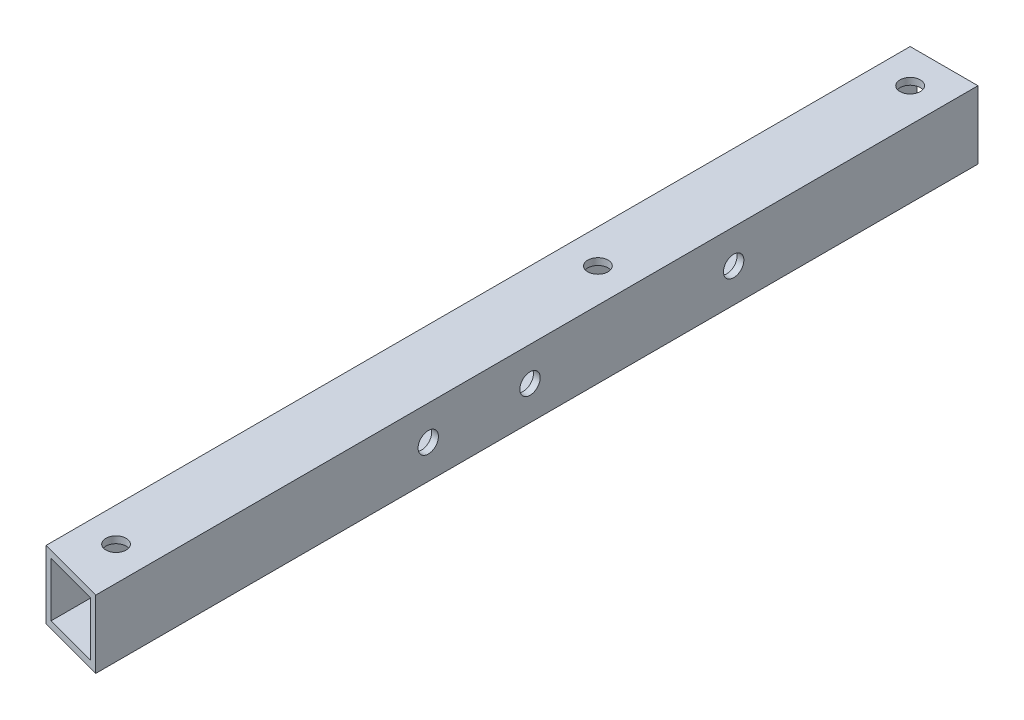
ISO-10303-21;
HEADER;
FILE_DESCRIPTION(('STEP AP214'),'2;1');
FILE_NAME('part.step','',(''),(''),'','','');
FILE_SCHEMA(('AUTOMOTIVE_DESIGN { 1 0 10303 214 1 1 1 1 }'));
ENDSEC;
DATA;
#1=APPLICATION_CONTEXT('core data for automotive mechanical design processes');
#2=APPLICATION_PROTOCOL_DEFINITION('international standard','automotive_design',2000,#1);
#3=PRODUCT_CONTEXT('',#1,'mechanical');
#4=PRODUCT('Part','Part','',(#3));
#5=PRODUCT_RELATED_PRODUCT_CATEGORY('part','',(#4));
#6=PRODUCT_DEFINITION_FORMATION('','',#4);
#7=PRODUCT_DEFINITION_CONTEXT('part definition',#1,'design');
#8=PRODUCT_DEFINITION('design','',#6,#7);
#9=PRODUCT_DEFINITION_SHAPE('','',#8);
#10=(LENGTH_UNIT() NAMED_UNIT(*) SI_UNIT(.MILLI.,.METRE.));
#11=(NAMED_UNIT(*) PLANE_ANGLE_UNIT() SI_UNIT($,.RADIAN.));
#12=(NAMED_UNIT(*) SI_UNIT($,.STERADIAN.) SOLID_ANGLE_UNIT());
#13=UNCERTAINTY_MEASURE_WITH_UNIT(LENGTH_MEASURE(1.E-05),#10,'distance_accuracy_value','');
#14=(GEOMETRIC_REPRESENTATION_CONTEXT(3) GLOBAL_UNCERTAINTY_ASSIGNED_CONTEXT((#13)) GLOBAL_UNIT_ASSIGNED_CONTEXT((#10,
#11,#12)) REPRESENTATION_CONTEXT('',''));
#15=CARTESIAN_POINT('',(0.,0.,0.));
#16=DIRECTION('',(0.,0.,1.));
#17=DIRECTION('',(1.,0.,0.));
#18=AXIS2_PLACEMENT_3D('',#15,#16,#17);
#19=CARTESIAN_POINT('',(0.,0.,0.));
#20=DIRECTION('',(0.,0.,1.));
#21=DIRECTION('',(1.,0.,0.));
#22=AXIS2_PLACEMENT_3D('',#19,#20,#21);
#23=PLANE('',#22);
#24=DIRECTION('',(0.,1.,0.));
#25=VECTOR('',#24,1.);
#26=CARTESIAN_POINT('',(4.99999999999999,5.,0.));
#27=LINE('',#26,#25);
#28=CARTESIAN_POINT('',(5.,-5.,0.));
#29=VERTEX_POINT('',#28);
#30=CARTESIAN_POINT('',(4.99999999999999,5.,0.));
#31=VERTEX_POINT('',#30);
#32=EDGE_CURVE('E158',#29,#31,#27,.T.);
#33=ORIENTED_EDGE('',*,*,#32,.F.);
#34=DIRECTION('',(1.,0.,0.));
#35=VECTOR('',#34,1.);
#36=CARTESIAN_POINT('',(5.,-5.,0.));
#37=LINE('',#36,#35);
#38=CARTESIAN_POINT('',(-5.,-5.,0.));
#39=VERTEX_POINT('',#38);
#40=EDGE_CURVE('E143',#39,#29,#37,.T.);
#41=ORIENTED_EDGE('',*,*,#40,.F.);
#42=DIRECTION('',(0.,-1.,0.));
#43=VECTOR('',#42,1.);
#44=CARTESIAN_POINT('',(-5.,5.,0.));
#45=LINE('',#44,#43);
#46=CARTESIAN_POINT('',(-5.,5.,0.));
#47=VERTEX_POINT('',#46);
#48=EDGE_CURVE('E152',#47,#39,#45,.T.);
#49=ORIENTED_EDGE('',*,*,#48,.F.);
#50=DIRECTION('',(-1.,0.,0.));
#51=VECTOR('',#50,1.);
#52=CARTESIAN_POINT('',(4.99999999999999,5.,0.));
#53=LINE('',#52,#51);
#54=EDGE_CURVE('E160',#31,#47,#53,.T.);
#55=ORIENTED_EDGE('',*,*,#54,.F.);
#56=EDGE_LOOP('',(#33,#41,#49,#55));
#57=FACE_BOUND('',#56,.T.);
#58=DIRECTION('',(0.,1.,0.));
#59=VECTOR('',#58,1.);
#60=CARTESIAN_POINT('',(4.,0.,0.));
#61=LINE('',#60,#59);
#62=CARTESIAN_POINT('',(4.,-4.,0.));
#63=VERTEX_POINT('',#62);
#64=CARTESIAN_POINT('',(3.99999999999999,4.,0.));
#65=VERTEX_POINT('',#64);
#66=EDGE_CURVE('E233',#63,#65,#61,.T.);
#67=ORIENTED_EDGE('',*,*,#66,.T.);
#68=DIRECTION('',(-1.,0.,0.));
#69=VECTOR('',#68,1.);
#70=CARTESIAN_POINT('',(0.,4.,0.));
#71=LINE('',#70,#69);
#72=CARTESIAN_POINT('',(-4.,4.,0.));
#73=VERTEX_POINT('',#72);
#74=EDGE_CURVE('E236',#65,#73,#71,.T.);
#75=ORIENTED_EDGE('',*,*,#74,.T.);
#76=DIRECTION('',(0.,-1.,0.));
#77=VECTOR('',#76,1.);
#78=CARTESIAN_POINT('',(-4.,0.,0.));
#79=LINE('',#78,#77);
#80=CARTESIAN_POINT('',(-4.,-4.,0.));
#81=VERTEX_POINT('',#80);
#82=EDGE_CURVE('E239',#73,#81,#79,.T.);
#83=ORIENTED_EDGE('',*,*,#82,.T.);
#84=DIRECTION('',(1.,0.,0.));
#85=VECTOR('',#84,1.);
#86=CARTESIAN_POINT('',(0.,-4.,0.));
#87=LINE('',#86,#85);
#88=EDGE_CURVE('E242',#81,#63,#87,.T.);
#89=ORIENTED_EDGE('',*,*,#88,.T.);
#90=EDGE_LOOP('',(#67,#75,#83,#89));
#91=FACE_BOUND('',#90,.T.);
#92=ADVANCED_FACE('F65',(#57,#91),#23,.F.);
#93=CARTESIAN_POINT('',(4.99999999999999,5.,130.));
#94=DIRECTION('',(-1.,0.,0.));
#95=DIRECTION('',(0.,-1.,0.));
#96=AXIS2_PLACEMENT_3D('',#93,#94,#95);
#97=PLANE('',#96);
#98=CARTESIAN_POINT('',(5.,0.,36.));
#99=DIRECTION('',(1.,0.,0.));
#100=DIRECTION('',(0.,1.,0.));
#101=AXIS2_PLACEMENT_3D('',#98,#99,#100);
#102=CIRCLE('',#101,1.5);
#103=CARTESIAN_POINT('',(5.,1.50000000000001,36.));
#104=VERTEX_POINT('',#103);
#105=EDGE_CURVE('E373',#104,#104,#102,.T.);
#106=ORIENTED_EDGE('',*,*,#105,.F.);
#107=EDGE_LOOP('',(#106));
#108=FACE_BOUND('',#107,.T.);
#109=CARTESIAN_POINT('',(5.,0.,66.));
#110=DIRECTION('',(1.,0.,0.));
#111=DIRECTION('',(0.,1.,0.));
#112=AXIS2_PLACEMENT_3D('',#109,#110,#111);
#113=CIRCLE('',#112,1.5);
#114=CARTESIAN_POINT('',(5.,1.5,66.));
#115=VERTEX_POINT('',#114);
#116=EDGE_CURVE('E374',#115,#115,#113,.T.);
#117=ORIENTED_EDGE('',*,*,#116,.F.);
#118=EDGE_LOOP('',(#117));
#119=FACE_BOUND('',#118,.T.);
#120=CARTESIAN_POINT('',(5.,0.,81.));
#121=DIRECTION('',(1.,0.,0.));
#122=DIRECTION('',(0.,1.,0.));
#123=AXIS2_PLACEMENT_3D('',#120,#121,#122);
#124=CIRCLE('',#123,1.5);
#125=CARTESIAN_POINT('',(5.,1.49999999999999,81.));
#126=VERTEX_POINT('',#125);
#127=EDGE_CURVE('E383',#126,#126,#124,.T.);
#128=ORIENTED_EDGE('',*,*,#127,.F.);
#129=EDGE_LOOP('',(#128));
#130=FACE_BOUND('',#129,.T.);
#131=ORIENTED_EDGE('',*,*,#32,.T.);
#132=DIRECTION('',(0.,0.,-1.));
#133=VECTOR('',#132,1.);
#134=CARTESIAN_POINT('',(4.99999999999999,5.,130.));
#135=LINE('',#134,#133);
#136=CARTESIAN_POINT('',(5.,5.,130.));
#137=VERTEX_POINT('',#136);
#138=EDGE_CURVE('E74',#137,#31,#135,.T.);
#139=ORIENTED_EDGE('',*,*,#138,.F.);
#140=DIRECTION('',(0.,1.,0.));
#141=VECTOR('',#140,1.);
#142=CARTESIAN_POINT('',(4.99999999999999,5.,130.));
#143=LINE('',#142,#141);
#144=CARTESIAN_POINT('',(5.,-5.,130.));
#145=VERTEX_POINT('',#144);
#146=EDGE_CURVE('E132',#145,#137,#143,.T.);
#147=ORIENTED_EDGE('',*,*,#146,.F.);
#148=DIRECTION('',(0.,0.,-1.));
#149=VECTOR('',#148,1.);
#150=CARTESIAN_POINT('',(5.,-5.,130.));
#151=LINE('',#150,#149);
#152=EDGE_CURVE('E140',#145,#29,#151,.T.);
#153=ORIENTED_EDGE('',*,*,#152,.T.);
#154=EDGE_LOOP('',(#131,#139,#147,#153));
#155=FACE_BOUND('',#154,.T.);
#156=ADVANCED_FACE('F67',(#108,#119,#130,#155),#97,.F.);
#157=CARTESIAN_POINT('',(4.99999999999999,5.,130.));
#158=DIRECTION('',(0.,-1.,0.));
#159=DIRECTION('',(0.,0.,-1.));
#160=AXIS2_PLACEMENT_3D('',#157,#158,#159);
#161=PLANE('',#160);
#162=CARTESIAN_POINT('',(0.,5.,5.));
#163=DIRECTION('',(0.,-1.,0.));
#164=DIRECTION('',(0.,0.,-1.));
#165=AXIS2_PLACEMENT_3D('',#162,#163,#164);
#166=CIRCLE('',#165,1.5);
#167=CARTESIAN_POINT('',(0.,5.,3.5));
#168=VERTEX_POINT('',#167);
#169=EDGE_CURVE('E204',#168,#168,#166,.T.);
#170=ORIENTED_EDGE('',*,*,#169,.T.);
#171=EDGE_LOOP('',(#170));
#172=FACE_BOUND('',#171,.T.);
#173=CARTESIAN_POINT('',(0.,5.,122.));
#174=DIRECTION('',(0.,-1.,0.));
#175=DIRECTION('',(0.,0.,-1.));
#176=AXIS2_PLACEMENT_3D('',#173,#174,#175);
#177=CIRCLE('',#176,1.5);
#178=CARTESIAN_POINT('',(0.,5.,120.5));
#179=VERTEX_POINT('',#178);
#180=EDGE_CURVE('E210',#179,#179,#177,.T.);
#181=ORIENTED_EDGE('',*,*,#180,.T.);
#182=EDGE_LOOP('',(#181));
#183=FACE_BOUND('',#182,.T.);
#184=CARTESIAN_POINT('',(0.,5.,51.));
#185=DIRECTION('',(0.,-1.,0.));
#186=DIRECTION('',(0.,0.,-1.));
#187=AXIS2_PLACEMENT_3D('',#184,#185,#186);
#188=CIRCLE('',#187,1.5);
#189=CARTESIAN_POINT('',(0.,5.,49.5));
#190=VERTEX_POINT('',#189);
#191=EDGE_CURVE('E172',#190,#190,#188,.T.);
#192=ORIENTED_EDGE('',*,*,#191,.T.);
#193=EDGE_LOOP('',(#192));
#194=FACE_BOUND('',#193,.T.);
#195=DIRECTION('',(0.,0.,-1.));
#196=VECTOR('',#195,1.);
#197=CARTESIAN_POINT('',(-5.,5.,130.));
#198=LINE('',#197,#196);
#199=CARTESIAN_POINT('',(-5.,5.,127.320508075689));
#200=VERTEX_POINT('',#199);
#201=EDGE_CURVE('E166',#200,#47,#198,.T.);
#202=ORIENTED_EDGE('',*,*,#201,.F.);
#203=DIRECTION('',(0.96592582628907,0.,0.258819045102515));
#204=VECTOR('',#203,1.);
#205=CARTESIAN_POINT('',(5.,5.,130.));
#206=LINE('',#205,#204);
#207=EDGE_CURVE('E137',#200,#137,#206,.T.);
#208=ORIENTED_EDGE('',*,*,#207,.T.);
#209=ORIENTED_EDGE('',*,*,#138,.T.);
#210=ORIENTED_EDGE('',*,*,#54,.T.);
#211=EDGE_LOOP('',(#202,#208,#209,#210));
#212=FACE_BOUND('',#211,.T.);
#213=ADVANCED_FACE('F290',(#172,#183,#194,#212),#161,.F.);
#214=CARTESIAN_POINT('',(-5.,5.,130.));
#215=DIRECTION('',(1.,0.,0.));
#216=DIRECTION('',(0.,0.,-1.));
#217=AXIS2_PLACEMENT_3D('',#214,#215,#216);
#218=PLANE('',#217);
#219=CARTESIAN_POINT('',(-5.00000000000001,0.,36.));
#220=DIRECTION('',(1.,0.,0.));
#221=DIRECTION('',(0.,1.,0.));
#222=AXIS2_PLACEMENT_3D('',#219,#220,#221);
#223=CIRCLE('',#222,1.5);
#224=CARTESIAN_POINT('',(-5.00000000000001,1.49999999999999,36.));
#225=VERTEX_POINT('',#224);
#226=EDGE_CURVE('E185',#225,#225,#223,.T.);
#227=ORIENTED_EDGE('',*,*,#226,.T.);
#228=EDGE_LOOP('',(#227));
#229=FACE_BOUND('',#228,.T.);
#230=CARTESIAN_POINT('',(-5.00000000000001,0.,66.));
#231=DIRECTION('',(1.,0.,0.));
#232=DIRECTION('',(0.,1.,0.));
#233=AXIS2_PLACEMENT_3D('',#230,#231,#232);
#234=CIRCLE('',#233,1.5);
#235=CARTESIAN_POINT('',(-5.00000000000001,1.49999999999998,66.));
#236=VERTEX_POINT('',#235);
#237=EDGE_CURVE('E379',#236,#236,#234,.T.);
#238=ORIENTED_EDGE('',*,*,#237,.T.);
#239=EDGE_LOOP('',(#238));
#240=FACE_BOUND('',#239,.T.);
#241=CARTESIAN_POINT('',(-5.00000000000001,0.,81.));
#242=DIRECTION('',(1.,0.,0.));
#243=DIRECTION('',(0.,1.,0.));
#244=AXIS2_PLACEMENT_3D('',#241,#242,#243);
#245=CIRCLE('',#244,1.5);
#246=CARTESIAN_POINT('',(-5.00000000000001,1.49999999999998,81.));
#247=VERTEX_POINT('',#246);
#248=EDGE_CURVE('E198',#247,#247,#245,.T.);
#249=ORIENTED_EDGE('',*,*,#248,.T.);
#250=EDGE_LOOP('',(#249));
#251=FACE_BOUND('',#250,.T.);
#252=DIRECTION('',(0.,0.,-1.));
#253=VECTOR('',#252,1.);
#254=CARTESIAN_POINT('',(-5.,-5.,130.));
#255=LINE('',#254,#253);
#256=CARTESIAN_POINT('',(-5.,-5.,127.320508075689));
#257=VERTEX_POINT('',#256);
#258=EDGE_CURVE('E147',#257,#39,#255,.T.);
#259=ORIENTED_EDGE('',*,*,#258,.F.);
#260=DIRECTION('',(0.,-1.,0.));
#261=VECTOR('',#260,1.);
#262=CARTESIAN_POINT('',(-5.,5.,127.320508075689));
#263=LINE('',#262,#261);
#264=EDGE_CURVE('E82',#200,#257,#263,.T.);
#265=ORIENTED_EDGE('',*,*,#264,.F.);
#266=ORIENTED_EDGE('',*,*,#201,.T.);
#267=ORIENTED_EDGE('',*,*,#48,.T.);
#268=EDGE_LOOP('',(#259,#265,#266,#267));
#269=FACE_BOUND('',#268,.T.);
#270=ADVANCED_FACE('F296',(#229,#240,#251,#269),#218,.F.);
#271=CARTESIAN_POINT('',(5.,-5.,130.));
#272=DIRECTION('',(0.,1.,0.));
#273=DIRECTION('',(0.,0.,1.));
#274=AXIS2_PLACEMENT_3D('',#271,#272,#273);
#275=PLANE('',#274);
#276=CARTESIAN_POINT('',(0.,-5.,5.));
#277=DIRECTION('',(0.,-1.,0.));
#278=DIRECTION('',(0.,0.,-1.));
#279=AXIS2_PLACEMENT_3D('',#276,#277,#278);
#280=CIRCLE('',#279,1.5);
#281=CARTESIAN_POINT('',(0.,-5.,3.5));
#282=VERTEX_POINT('',#281);
#283=EDGE_CURVE('E213',#282,#282,#280,.T.);
#284=ORIENTED_EDGE('',*,*,#283,.F.);
#285=EDGE_LOOP('',(#284));
#286=FACE_BOUND('',#285,.T.);
#287=CARTESIAN_POINT('',(0.,-5.,122.));
#288=DIRECTION('',(0.,-1.,0.));
#289=DIRECTION('',(0.,0.,-1.));
#290=AXIS2_PLACEMENT_3D('',#287,#288,#289);
#291=CIRCLE('',#290,1.5);
#292=CARTESIAN_POINT('',(0.,-5.,120.5));
#293=VERTEX_POINT('',#292);
#294=EDGE_CURVE('E205',#293,#293,#291,.T.);
#295=ORIENTED_EDGE('',*,*,#294,.F.);
#296=EDGE_LOOP('',(#295));
#297=FACE_BOUND('',#296,.T.);
#298=CARTESIAN_POINT('',(0.,-5.,51.));
#299=DIRECTION('',(0.,-1.,0.));
#300=DIRECTION('',(0.,0.,-1.));
#301=AXIS2_PLACEMENT_3D('',#298,#299,#300);
#302=CIRCLE('',#301,1.5);
#303=CARTESIAN_POINT('',(0.,-5.,49.5));
#304=VERTEX_POINT('',#303);
#305=EDGE_CURVE('E136',#304,#304,#302,.T.);
#306=ORIENTED_EDGE('',*,*,#305,.F.);
#307=EDGE_LOOP('',(#306));
#308=FACE_BOUND('',#307,.T.);
#309=ORIENTED_EDGE('',*,*,#152,.F.);
#310=DIRECTION('',(0.96592582628907,0.,0.258819045102515));
#311=VECTOR('',#310,1.);
#312=CARTESIAN_POINT('',(5.,-5.,130.));
#313=LINE('',#312,#311);
#314=EDGE_CURVE('E128',#257,#145,#313,.T.);
#315=ORIENTED_EDGE('',*,*,#314,.F.);
#316=ORIENTED_EDGE('',*,*,#258,.T.);
#317=ORIENTED_EDGE('',*,*,#40,.T.);
#318=EDGE_LOOP('',(#309,#315,#316,#317));
#319=FACE_BOUND('',#318,.T.);
#320=ADVANCED_FACE('F141',(#286,#297,#308,#319),#275,.F.);
#321=CARTESIAN_POINT('',(4.,0.,130.));
#322=DIRECTION('',(-1.,0.,0.));
#323=DIRECTION('',(0.,-1.,0.));
#324=AXIS2_PLACEMENT_3D('',#321,#322,#323);
#325=PLANE('',#324);
#326=CARTESIAN_POINT('',(4.,0.,36.));
#327=DIRECTION('',(-1.,0.,0.));
#328=DIRECTION('',(0.,-1.,0.));
#329=AXIS2_PLACEMENT_3D('',#326,#327,#328);
#330=CIRCLE('',#329,1.5);
#331=CARTESIAN_POINT('',(4.,-1.5,36.));
#332=VERTEX_POINT('',#331);
#333=EDGE_CURVE('E201',#332,#332,#330,.T.);
#334=ORIENTED_EDGE('',*,*,#333,.F.);
#335=EDGE_LOOP('',(#334));
#336=FACE_BOUND('',#335,.T.);
#337=CARTESIAN_POINT('',(4.,0.,66.));
#338=DIRECTION('',(-1.,0.,0.));
#339=DIRECTION('',(0.,-1.,0.));
#340=AXIS2_PLACEMENT_3D('',#337,#338,#339);
#341=CIRCLE('',#340,1.5);
#342=CARTESIAN_POINT('',(4.,-1.5,66.));
#343=VERTEX_POINT('',#342);
#344=EDGE_CURVE('E188',#343,#343,#341,.T.);
#345=ORIENTED_EDGE('',*,*,#344,.F.);
#346=EDGE_LOOP('',(#345));
#347=FACE_BOUND('',#346,.T.);
#348=CARTESIAN_POINT('',(4.,0.,81.));
#349=DIRECTION('',(-1.,0.,0.));
#350=DIRECTION('',(0.,-1.,0.));
#351=AXIS2_PLACEMENT_3D('',#348,#349,#350);
#352=CIRCLE('',#351,1.5);
#353=CARTESIAN_POINT('',(4.,-1.5,81.));
#354=VERTEX_POINT('',#353);
#355=EDGE_CURVE('E184',#354,#354,#352,.T.);
#356=ORIENTED_EDGE('',*,*,#355,.F.);
#357=EDGE_LOOP('',(#356));
#358=FACE_BOUND('',#357,.T.);
#359=DIRECTION('',(0.,-1.,0.));
#360=VECTOR('',#359,1.);
#361=CARTESIAN_POINT('',(4.,0.,129.732050807569));
#362=LINE('',#361,#360);
#363=CARTESIAN_POINT('',(3.99999999999999,4.,129.732050807569));
#364=VERTEX_POINT('',#363);
#365=CARTESIAN_POINT('',(4.,-4.,129.732050807569));
#366=VERTEX_POINT('',#365);
#367=EDGE_CURVE('E89',#364,#366,#362,.T.);
#368=ORIENTED_EDGE('',*,*,#367,.F.);
#369=DIRECTION('',(0.,0.,-1.));
#370=VECTOR('',#369,1.);
#371=CARTESIAN_POINT('',(3.99999999999999,4.,130.));
#372=LINE('',#371,#370);
#373=EDGE_CURVE('E156',#364,#65,#372,.T.);
#374=ORIENTED_EDGE('',*,*,#373,.T.);
#375=ORIENTED_EDGE('',*,*,#66,.F.);
#376=DIRECTION('',(0.,0.,-1.));
#377=VECTOR('',#376,1.);
#378=CARTESIAN_POINT('',(4.,-4.,130.));
#379=LINE('',#378,#377);
#380=EDGE_CURVE('E245',#366,#63,#379,.T.);
#381=ORIENTED_EDGE('',*,*,#380,.F.);
#382=EDGE_LOOP('',(#368,#374,#375,#381));
#383=FACE_BOUND('',#382,.T.);
#384=ADVANCED_FACE('F257',(#336,#347,#358,#383),#325,.T.);
#385=CARTESIAN_POINT('',(0.,4.,130.));
#386=DIRECTION('',(0.,-1.,0.));
#387=DIRECTION('',(0.,0.,-1.));
#388=AXIS2_PLACEMENT_3D('',#385,#386,#387);
#389=PLANE('',#388);
#390=CARTESIAN_POINT('',(0.,4.,5.));
#391=DIRECTION('',(0.,-1.,0.));
#392=DIRECTION('',(0.,0.,-1.));
#393=AXIS2_PLACEMENT_3D('',#390,#391,#392);
#394=CIRCLE('',#393,1.5);
#395=CARTESIAN_POINT('',(0.,4.,3.5));
#396=VERTEX_POINT('',#395);
#397=EDGE_CURVE('E181',#396,#396,#394,.T.);
#398=ORIENTED_EDGE('',*,*,#397,.F.);
#399=EDGE_LOOP('',(#398));
#400=FACE_BOUND('',#399,.T.);
#401=CARTESIAN_POINT('',(0.,4.,122.));
#402=DIRECTION('',(0.,-1.,0.));
#403=DIRECTION('',(0.,0.,-1.));
#404=AXIS2_PLACEMENT_3D('',#401,#402,#403);
#405=CIRCLE('',#404,1.5);
#406=CARTESIAN_POINT('',(0.,4.,120.5));
#407=VERTEX_POINT('',#406);
#408=EDGE_CURVE('E177',#407,#407,#405,.T.);
#409=ORIENTED_EDGE('',*,*,#408,.F.);
#410=EDGE_LOOP('',(#409));
#411=FACE_BOUND('',#410,.T.);
#412=DIRECTION('',(0.96592582628907,0.,0.258819045102515));
#413=VECTOR('',#412,1.);
#414=CARTESIAN_POINT('',(0.334936490538888,4.,128.75));
#415=LINE('',#414,#413);
#416=CARTESIAN_POINT('',(-4.,4.,127.58845726812));
#417=VERTEX_POINT('',#416);
#418=EDGE_CURVE('E226',#417,#364,#415,.T.);
#419=ORIENTED_EDGE('',*,*,#418,.F.);
#420=DIRECTION('',(0.,0.,-1.));
#421=VECTOR('',#420,1.);
#422=CARTESIAN_POINT('',(-4.,4.,130.));
#423=LINE('',#422,#421);
#424=EDGE_CURVE('E248',#417,#73,#423,.T.);
#425=ORIENTED_EDGE('',*,*,#424,.T.);
#426=ORIENTED_EDGE('',*,*,#74,.F.);
#427=ORIENTED_EDGE('',*,*,#373,.F.);
#428=EDGE_LOOP('',(#419,#425,#426,#427));
#429=FACE_BOUND('',#428,.T.);
#430=CARTESIAN_POINT('',(0.,4.,51.));
#431=DIRECTION('',(0.,-1.,0.));
#432=DIRECTION('',(0.,0.,-1.));
#433=AXIS2_PLACEMENT_3D('',#430,#431,#432);
#434=CIRCLE('',#433,1.5);
#435=CARTESIAN_POINT('',(0.,4.,49.5));
#436=VERTEX_POINT('',#435);
#437=EDGE_CURVE('E171',#436,#436,#434,.T.);
#438=ORIENTED_EDGE('',*,*,#437,.F.);
#439=EDGE_LOOP('',(#438));
#440=FACE_BOUND('',#439,.T.);
#441=ADVANCED_FACE('F259',(#400,#411,#429,#440),#389,.T.);
#442=CARTESIAN_POINT('',(-4.,0.,130.));
#443=DIRECTION('',(1.,0.,0.));
#444=DIRECTION('',(0.,0.,-1.));
#445=AXIS2_PLACEMENT_3D('',#442,#443,#444);
#446=PLANE('',#445);
#447=CARTESIAN_POINT('',(-4.,0.,36.));
#448=DIRECTION('',(1.,0.,0.));
#449=DIRECTION('',(0.,0.,-1.));
#450=AXIS2_PLACEMENT_3D('',#447,#448,#449);
#451=CIRCLE('',#450,1.5);
#452=CARTESIAN_POINT('',(-4.,0.,34.5));
#453=VERTEX_POINT('',#452);
#454=EDGE_CURVE('E69',#453,#453,#451,.T.);
#455=ORIENTED_EDGE('',*,*,#454,.F.);
#456=EDGE_LOOP('',(#455));
#457=FACE_BOUND('',#456,.T.);
#458=CARTESIAN_POINT('',(-4.,0.,66.));
#459=DIRECTION('',(1.,0.,0.));
#460=DIRECTION('',(0.,0.,-1.));
#461=AXIS2_PLACEMENT_3D('',#458,#459,#460);
#462=CIRCLE('',#461,1.5);
#463=CARTESIAN_POINT('',(-4.,0.,64.5));
#464=VERTEX_POINT('',#463);
#465=EDGE_CURVE('E186',#464,#464,#462,.T.);
#466=ORIENTED_EDGE('',*,*,#465,.F.);
#467=EDGE_LOOP('',(#466));
#468=FACE_BOUND('',#467,.T.);
#469=CARTESIAN_POINT('',(-4.,0.,81.));
#470=DIRECTION('',(1.,0.,0.));
#471=DIRECTION('',(0.,0.,-1.));
#472=AXIS2_PLACEMENT_3D('',#469,#470,#471);
#473=CIRCLE('',#472,1.5);
#474=CARTESIAN_POINT('',(-4.,0.,79.5));
#475=VERTEX_POINT('',#474);
#476=EDGE_CURVE('E182',#475,#475,#473,.T.);
#477=ORIENTED_EDGE('',*,*,#476,.F.);
#478=EDGE_LOOP('',(#477));
#479=FACE_BOUND('',#478,.T.);
#480=DIRECTION('',(0.,1.,0.));
#481=VECTOR('',#480,1.);
#482=CARTESIAN_POINT('',(-4.,0.,127.58845726812));
#483=LINE('',#482,#481);
#484=CARTESIAN_POINT('',(-4.,-4.,127.58845726812));
#485=VERTEX_POINT('',#484);
#486=EDGE_CURVE('E224',#485,#417,#483,.T.);
#487=ORIENTED_EDGE('',*,*,#486,.F.);
#488=DIRECTION('',(0.,0.,-1.));
#489=VECTOR('',#488,1.);
#490=CARTESIAN_POINT('',(-4.,-4.,130.));
#491=LINE('',#490,#489);
#492=EDGE_CURVE('E247',#485,#81,#491,.T.);
#493=ORIENTED_EDGE('',*,*,#492,.T.);
#494=ORIENTED_EDGE('',*,*,#82,.F.);
#495=ORIENTED_EDGE('',*,*,#424,.F.);
#496=EDGE_LOOP('',(#487,#493,#494,#495));
#497=FACE_BOUND('',#496,.T.);
#498=ADVANCED_FACE('F269',(#457,#468,#479,#497),#446,.T.);
#499=CARTESIAN_POINT('',(0.,-4.,130.));
#500=DIRECTION('',(0.,1.,0.));
#501=DIRECTION('',(0.,0.,1.));
#502=AXIS2_PLACEMENT_3D('',#499,#500,#501);
#503=PLANE('',#502);
#504=CARTESIAN_POINT('',(0.,-4.,5.));
#505=DIRECTION('',(0.,1.,0.));
#506=DIRECTION('',(0.,0.,1.));
#507=AXIS2_PLACEMENT_3D('',#504,#505,#506);
#508=CIRCLE('',#507,1.5);
#509=CARTESIAN_POINT('',(0.,-4.,6.5));
#510=VERTEX_POINT('',#509);
#511=EDGE_CURVE('E178',#510,#510,#508,.T.);
#512=ORIENTED_EDGE('',*,*,#511,.F.);
#513=EDGE_LOOP('',(#512));
#514=FACE_BOUND('',#513,.T.);
#515=CARTESIAN_POINT('',(0.,-4.,122.));
#516=DIRECTION('',(0.,1.,0.));
#517=DIRECTION('',(0.,0.,1.));
#518=AXIS2_PLACEMENT_3D('',#515,#516,#517);
#519=CIRCLE('',#518,1.5);
#520=CARTESIAN_POINT('',(0.,-4.,123.5));
#521=VERTEX_POINT('',#520);
#522=EDGE_CURVE('E174',#521,#521,#519,.T.);
#523=ORIENTED_EDGE('',*,*,#522,.F.);
#524=EDGE_LOOP('',(#523));
#525=FACE_BOUND('',#524,.T.);
#526=DIRECTION('',(-0.96592582628907,0.,-0.258819045102515));
#527=VECTOR('',#526,1.);
#528=CARTESIAN_POINT('',(0.334936490538888,-4.,128.75));
#529=LINE('',#528,#527);
#530=EDGE_CURVE('E12',#366,#485,#529,.T.);
#531=ORIENTED_EDGE('',*,*,#530,.F.);
#532=ORIENTED_EDGE('',*,*,#380,.T.);
#533=ORIENTED_EDGE('',*,*,#88,.F.);
#534=ORIENTED_EDGE('',*,*,#492,.F.);
#535=EDGE_LOOP('',(#531,#532,#533,#534));
#536=FACE_BOUND('',#535,.T.);
#537=CARTESIAN_POINT('',(0.,-4.,51.));
#538=DIRECTION('',(0.,1.,0.));
#539=DIRECTION('',(0.,0.,1.));
#540=AXIS2_PLACEMENT_3D('',#537,#538,#539);
#541=CIRCLE('',#540,1.5);
#542=CARTESIAN_POINT('',(0.,-4.,52.5));
#543=VERTEX_POINT('',#542);
#544=EDGE_CURVE('E169',#543,#543,#541,.T.);
#545=ORIENTED_EDGE('',*,*,#544,.F.);
#546=EDGE_LOOP('',(#545));
#547=FACE_BOUND('',#546,.T.);
#548=ADVANCED_FACE('F265',(#514,#525,#536,#547),#503,.T.);
#549=CARTESIAN_POINT('',(0.,5.,51.));
#550=DIRECTION('',(0.,-1.,0.));
#551=DIRECTION('',(0.,0.,-1.));
#552=AXIS2_PLACEMENT_3D('',#549,#550,#551);
#553=CYLINDRICAL_SURFACE('',#552,1.5);
#554=ORIENTED_EDGE('',*,*,#544,.T.);
#555=EDGE_LOOP('',(#554));
#556=FACE_BOUND('',#555,.T.);
#557=ORIENTED_EDGE('',*,*,#305,.T.);
#558=EDGE_LOOP('',(#557));
#559=FACE_BOUND('',#558,.T.);
#560=ADVANCED_FACE('F277',(#556,#559),#553,.F.);
#561=CARTESIAN_POINT('',(5.,5.,130.));
#562=DIRECTION('',(0.258819045102515,0.,-0.96592582628907));
#563=DIRECTION('',(-0.96592582628907,0.,-0.258819045102515));
#564=AXIS2_PLACEMENT_3D('',#561,#562,#563);
#565=PLANE('',#564);
#566=ORIENTED_EDGE('',*,*,#367,.T.);
#567=ORIENTED_EDGE('',*,*,#530,.T.);
#568=ORIENTED_EDGE('',*,*,#486,.T.);
#569=ORIENTED_EDGE('',*,*,#418,.T.);
#570=EDGE_LOOP('',(#566,#567,#568,#569));
#571=FACE_BOUND('',#570,.T.);
#572=ORIENTED_EDGE('',*,*,#314,.T.);
#573=ORIENTED_EDGE('',*,*,#146,.T.);
#574=ORIENTED_EDGE('',*,*,#207,.F.);
#575=ORIENTED_EDGE('',*,*,#264,.T.);
#576=EDGE_LOOP('',(#572,#573,#574,#575));
#577=FACE_BOUND('',#576,.T.);
#578=ADVANCED_FACE('F130',(#571,#577),#565,.F.);
#579=CARTESIAN_POINT('',(0.,5.,122.));
#580=DIRECTION('',(0.,-1.,0.));
#581=DIRECTION('',(0.,0.,-1.));
#582=AXIS2_PLACEMENT_3D('',#579,#580,#581);
#583=CYLINDRICAL_SURFACE('',#582,1.5);
#584=ORIENTED_EDGE('',*,*,#522,.T.);
#585=EDGE_LOOP('',(#584));
#586=FACE_BOUND('',#585,.T.);
#587=ORIENTED_EDGE('',*,*,#294,.T.);
#588=EDGE_LOOP('',(#587));
#589=FACE_BOUND('',#588,.T.);
#590=ADVANCED_FACE('F327',(#586,#589),#583,.F.);
#591=CARTESIAN_POINT('',(0.,5.,5.));
#592=DIRECTION('',(0.,-1.,0.));
#593=DIRECTION('',(0.,0.,-1.));
#594=AXIS2_PLACEMENT_3D('',#591,#592,#593);
#595=CYLINDRICAL_SURFACE('',#594,1.5);
#596=ORIENTED_EDGE('',*,*,#511,.T.);
#597=EDGE_LOOP('',(#596));
#598=FACE_BOUND('',#597,.T.);
#599=ORIENTED_EDGE('',*,*,#283,.T.);
#600=EDGE_LOOP('',(#599));
#601=FACE_BOUND('',#600,.T.);
#602=ADVANCED_FACE('F317',(#598,#601),#595,.F.);
#603=ORIENTED_EDGE('',*,*,#437,.T.);
#604=EDGE_LOOP('',(#603));
#605=FACE_BOUND('',#604,.T.);
#606=ORIENTED_EDGE('',*,*,#191,.F.);
#607=EDGE_LOOP('',(#606));
#608=FACE_BOUND('',#607,.T.);
#609=ADVANCED_FACE('F314',(#605,#608),#553,.F.);
#610=ORIENTED_EDGE('',*,*,#408,.T.);
#611=EDGE_LOOP('',(#610));
#612=FACE_BOUND('',#611,.T.);
#613=ORIENTED_EDGE('',*,*,#180,.F.);
#614=EDGE_LOOP('',(#613));
#615=FACE_BOUND('',#614,.T.);
#616=ADVANCED_FACE('F316',(#612,#615),#583,.F.);
#617=ORIENTED_EDGE('',*,*,#397,.T.);
#618=EDGE_LOOP('',(#617));
#619=FACE_BOUND('',#618,.T.);
#620=ORIENTED_EDGE('',*,*,#169,.F.);
#621=EDGE_LOOP('',(#620));
#622=FACE_BOUND('',#621,.T.);
#623=ADVANCED_FACE('F324',(#619,#622),#595,.F.);
#624=CARTESIAN_POINT('',(-5.00000000000001,0.,81.));
#625=DIRECTION('',(1.,0.,0.));
#626=DIRECTION('',(0.,1.,0.));
#627=AXIS2_PLACEMENT_3D('',#624,#625,#626);
#628=CYLINDRICAL_SURFACE('',#627,1.5);
#629=ORIENTED_EDGE('',*,*,#476,.T.);
#630=EDGE_LOOP('',(#629));
#631=FACE_BOUND('',#630,.T.);
#632=ORIENTED_EDGE('',*,*,#248,.F.);
#633=EDGE_LOOP('',(#632));
#634=FACE_BOUND('',#633,.T.);
#635=ADVANCED_FACE('F345',(#631,#634),#628,.F.);
#636=CARTESIAN_POINT('',(-5.00000000000001,0.,66.));
#637=DIRECTION('',(1.,0.,0.));
#638=DIRECTION('',(0.,1.,0.));
#639=AXIS2_PLACEMENT_3D('',#636,#637,#638);
#640=CYLINDRICAL_SURFACE('',#639,1.5);
#641=ORIENTED_EDGE('',*,*,#465,.T.);
#642=EDGE_LOOP('',(#641));
#643=FACE_BOUND('',#642,.T.);
#644=ORIENTED_EDGE('',*,*,#237,.F.);
#645=EDGE_LOOP('',(#644));
#646=FACE_BOUND('',#645,.T.);
#647=ADVANCED_FACE('F348',(#643,#646),#640,.F.);
#648=CARTESIAN_POINT('',(-5.00000000000001,0.,36.));
#649=DIRECTION('',(1.,0.,0.));
#650=DIRECTION('',(0.,1.,0.));
#651=AXIS2_PLACEMENT_3D('',#648,#649,#650);
#652=CYLINDRICAL_SURFACE('',#651,1.5);
#653=ORIENTED_EDGE('',*,*,#454,.T.);
#654=EDGE_LOOP('',(#653));
#655=FACE_BOUND('',#654,.T.);
#656=ORIENTED_EDGE('',*,*,#226,.F.);
#657=EDGE_LOOP('',(#656));
#658=FACE_BOUND('',#657,.T.);
#659=ADVANCED_FACE('F353',(#655,#658),#652,.F.);
#660=ORIENTED_EDGE('',*,*,#355,.T.);
#661=EDGE_LOOP('',(#660));
#662=FACE_BOUND('',#661,.T.);
#663=ORIENTED_EDGE('',*,*,#127,.T.);
#664=EDGE_LOOP('',(#663));
#665=FACE_BOUND('',#664,.T.);
#666=ADVANCED_FACE('F350',(#662,#665),#628,.F.);
#667=ORIENTED_EDGE('',*,*,#344,.T.);
#668=EDGE_LOOP('',(#667));
#669=FACE_BOUND('',#668,.T.);
#670=ORIENTED_EDGE('',*,*,#116,.T.);
#671=EDGE_LOOP('',(#670));
#672=FACE_BOUND('',#671,.T.);
#673=ADVANCED_FACE('F354',(#669,#672),#640,.F.);
#674=ORIENTED_EDGE('',*,*,#333,.T.);
#675=EDGE_LOOP('',(#674));
#676=FACE_BOUND('',#675,.T.);
#677=ORIENTED_EDGE('',*,*,#105,.T.);
#678=EDGE_LOOP('',(#677));
#679=FACE_BOUND('',#678,.T.);
#680=ADVANCED_FACE('F357',(#676,#679),#652,.F.);
#681=CLOSED_SHELL('',(#92,#156,#213,#270,#320,#384,#441,#498,#548,#560,#578,#590,#602,#609,#616,
#623,#635,#647,#659,#666,#673,#680));
#682=MANIFOLD_SOLID_BREP('B2',#681);
#683=ADVANCED_BREP_SHAPE_REPRESENTATION('',(#18,#682),#14);
#684=SHAPE_DEFINITION_REPRESENTATION(#9,#683);
ENDSEC;
END-ISO-10303-21;
